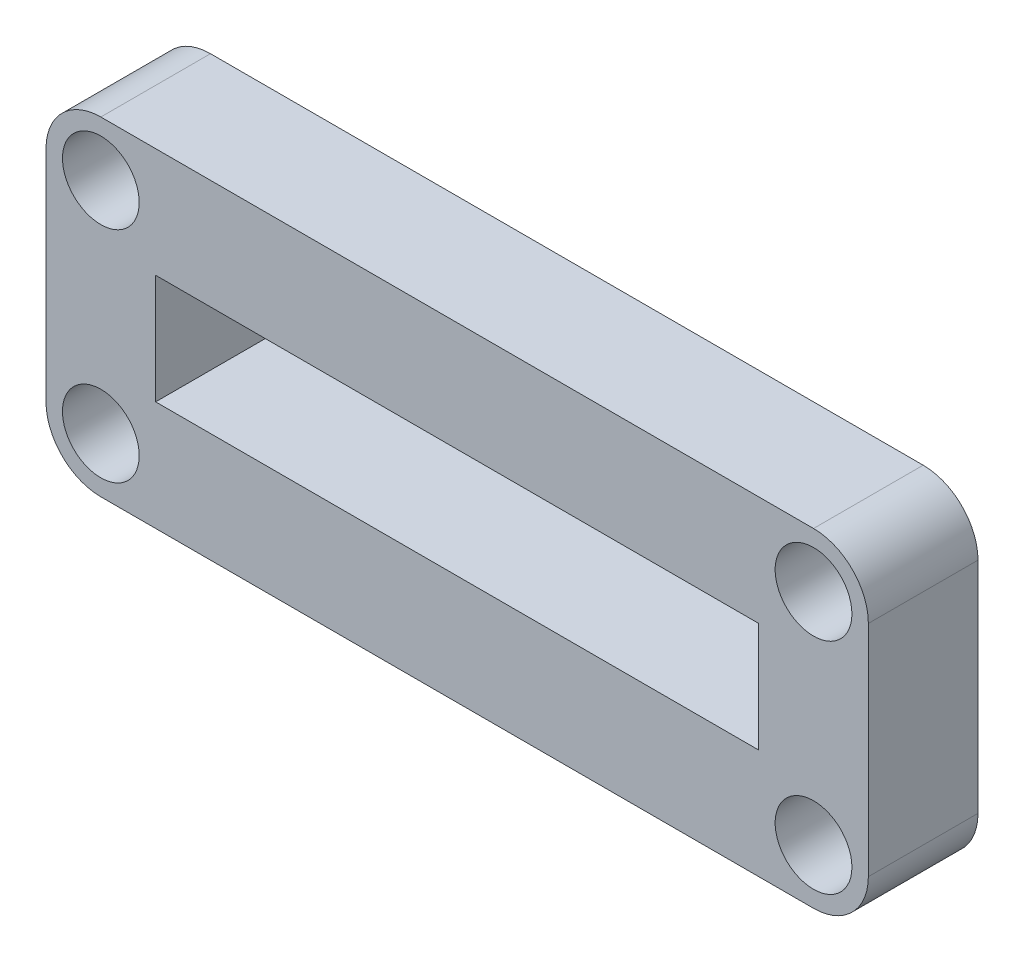
ISO-10303-21;
HEADER;
FILE_DESCRIPTION(('STEP AP214'),'2;1');
FILE_NAME('part.step','',(''),(''),'','','');
FILE_SCHEMA(('AUTOMOTIVE_DESIGN { 1 0 10303 214 1 1 1 1 }'));
ENDSEC;
DATA;
#1=APPLICATION_CONTEXT('core data for automotive mechanical design processes');
#2=APPLICATION_PROTOCOL_DEFINITION('international standard','automotive_design',2000,#1);
#3=PRODUCT_CONTEXT('',#1,'mechanical');
#4=PRODUCT('Part','Part','',(#3));
#5=PRODUCT_RELATED_PRODUCT_CATEGORY('part','',(#4));
#6=PRODUCT_DEFINITION_FORMATION('','',#4);
#7=PRODUCT_DEFINITION_CONTEXT('part definition',#1,'design');
#8=PRODUCT_DEFINITION('design','',#6,#7);
#9=PRODUCT_DEFINITION_SHAPE('','',#8);
#10=(LENGTH_UNIT() NAMED_UNIT(*) SI_UNIT(.MILLI.,.METRE.));
#11=(NAMED_UNIT(*) PLANE_ANGLE_UNIT() SI_UNIT($,.RADIAN.));
#12=(NAMED_UNIT(*) SI_UNIT($,.STERADIAN.) SOLID_ANGLE_UNIT());
#13=UNCERTAINTY_MEASURE_WITH_UNIT(LENGTH_MEASURE(1.E-05),#10,'distance_accuracy_value','');
#14=(GEOMETRIC_REPRESENTATION_CONTEXT(3) GLOBAL_UNCERTAINTY_ASSIGNED_CONTEXT((#13)) GLOBAL_UNIT_ASSIGNED_CONTEXT((#10,
#11,#12)) REPRESENTATION_CONTEXT('',''));
#15=CARTESIAN_POINT('',(0.,0.,0.));
#16=DIRECTION('',(0.,0.,1.));
#17=DIRECTION('',(1.,0.,0.));
#18=AXIS2_PLACEMENT_3D('',#15,#16,#17);
#19=CARTESIAN_POINT('',(0.,0.,7.));
#20=DIRECTION('',(0.,0.,-1.));
#21=DIRECTION('',(-1.,0.,0.));
#22=AXIS2_PLACEMENT_3D('',#19,#20,#21);
#23=CYLINDRICAL_SURFACE('',#22,1.4);
#24=CARTESIAN_POINT('',(0.,0.,0.));
#25=DIRECTION('',(0.,0.,1.));
#26=DIRECTION('',(1.,0.,0.));
#27=AXIS2_PLACEMENT_3D('',#24,#25,#26);
#28=CIRCLE('',#27,1.4);
#29=CARTESIAN_POINT('',(1.4,0.,0.));
#30=VERTEX_POINT('',#29);
#31=EDGE_CURVE('E206',#30,#30,#28,.T.);
#32=ORIENTED_EDGE('',*,*,#31,.F.);
#33=EDGE_LOOP('',(#32));
#34=FACE_BOUND('',#33,.T.);
#35=CARTESIAN_POINT('',(0.,0.,4.));
#36=DIRECTION('',(0.,0.,1.));
#37=DIRECTION('',(1.,0.,0.));
#38=AXIS2_PLACEMENT_3D('',#35,#36,#37);
#39=CIRCLE('',#38,1.4);
#40=CARTESIAN_POINT('',(1.4,0.,4.));
#41=VERTEX_POINT('',#40);
#42=EDGE_CURVE('E176',#41,#41,#39,.T.);
#43=ORIENTED_EDGE('',*,*,#42,.T.);
#44=EDGE_LOOP('',(#43));
#45=FACE_BOUND('',#44,.T.);
#46=ADVANCED_FACE('F69',(#34,#45),#23,.F.);
#47=CARTESIAN_POINT('',(0.,-8.,7.));
#48=DIRECTION('',(0.,0.,-1.));
#49=DIRECTION('',(-1.,0.,0.));
#50=AXIS2_PLACEMENT_3D('',#47,#48,#49);
#51=CYLINDRICAL_SURFACE('',#50,1.4);
#52=CARTESIAN_POINT('',(0.,-8.,0.));
#53=DIRECTION('',(0.,0.,1.));
#54=DIRECTION('',(1.,0.,0.));
#55=AXIS2_PLACEMENT_3D('',#52,#53,#54);
#56=CIRCLE('',#55,1.4);
#57=CARTESIAN_POINT('',(1.4,-8.,0.));
#58=VERTEX_POINT('',#57);
#59=EDGE_CURVE('E203',#58,#58,#56,.T.);
#60=ORIENTED_EDGE('',*,*,#59,.F.);
#61=EDGE_LOOP('',(#60));
#62=FACE_BOUND('',#61,.T.);
#63=CARTESIAN_POINT('',(0.,-8.,4.));
#64=DIRECTION('',(0.,0.,1.));
#65=DIRECTION('',(1.,0.,0.));
#66=AXIS2_PLACEMENT_3D('',#63,#64,#65);
#67=CIRCLE('',#66,1.4);
#68=CARTESIAN_POINT('',(1.4,-8.,4.));
#69=VERTEX_POINT('',#68);
#70=EDGE_CURVE('E181',#69,#69,#67,.T.);
#71=ORIENTED_EDGE('',*,*,#70,.T.);
#72=EDGE_LOOP('',(#71));
#73=FACE_BOUND('',#72,.T.);
#74=ADVANCED_FACE('F302',(#62,#73),#51,.F.);
#75=CARTESIAN_POINT('',(26.,0.,7.));
#76=DIRECTION('',(0.,0.,-1.));
#77=DIRECTION('',(-1.,0.,0.));
#78=AXIS2_PLACEMENT_3D('',#75,#76,#77);
#79=CYLINDRICAL_SURFACE('',#78,1.4);
#80=CARTESIAN_POINT('',(26.,0.,0.));
#81=DIRECTION('',(0.,0.,1.));
#82=DIRECTION('',(1.,0.,0.));
#83=AXIS2_PLACEMENT_3D('',#80,#81,#82);
#84=CIRCLE('',#83,1.4);
#85=CARTESIAN_POINT('',(27.4,0.,0.));
#86=VERTEX_POINT('',#85);
#87=EDGE_CURVE('E200',#86,#86,#84,.T.);
#88=ORIENTED_EDGE('',*,*,#87,.F.);
#89=EDGE_LOOP('',(#88));
#90=FACE_BOUND('',#89,.T.);
#91=CARTESIAN_POINT('',(26.,0.,4.));
#92=DIRECTION('',(0.,0.,1.));
#93=DIRECTION('',(1.,0.,0.));
#94=AXIS2_PLACEMENT_3D('',#91,#92,#93);
#95=CIRCLE('',#94,1.4);
#96=CARTESIAN_POINT('',(27.4,0.,4.));
#97=VERTEX_POINT('',#96);
#98=EDGE_CURVE('E296',#97,#97,#95,.T.);
#99=ORIENTED_EDGE('',*,*,#98,.T.);
#100=EDGE_LOOP('',(#99));
#101=FACE_BOUND('',#100,.T.);
#102=ADVANCED_FACE('F315',(#90,#101),#79,.F.);
#103=CARTESIAN_POINT('',(26.,-8.,7.));
#104=DIRECTION('',(0.,0.,-1.));
#105=DIRECTION('',(-1.,0.,0.));
#106=AXIS2_PLACEMENT_3D('',#103,#104,#105);
#107=CYLINDRICAL_SURFACE('',#106,1.4);
#108=CARTESIAN_POINT('',(26.,-8.,0.));
#109=DIRECTION('',(0.,0.,1.));
#110=DIRECTION('',(1.,0.,0.));
#111=AXIS2_PLACEMENT_3D('',#108,#109,#110);
#112=CIRCLE('',#111,1.4);
#113=CARTESIAN_POINT('',(27.4,-8.,0.));
#114=VERTEX_POINT('',#113);
#115=EDGE_CURVE('E188',#114,#114,#112,.T.);
#116=ORIENTED_EDGE('',*,*,#115,.F.);
#117=EDGE_LOOP('',(#116));
#118=FACE_BOUND('',#117,.T.);
#119=CARTESIAN_POINT('',(26.,-8.,4.));
#120=DIRECTION('',(0.,0.,1.));
#121=DIRECTION('',(1.,0.,0.));
#122=AXIS2_PLACEMENT_3D('',#119,#120,#121);
#123=CIRCLE('',#122,1.4);
#124=CARTESIAN_POINT('',(27.4,-8.,4.));
#125=VERTEX_POINT('',#124);
#126=EDGE_CURVE('E293',#125,#125,#123,.T.);
#127=ORIENTED_EDGE('',*,*,#126,.T.);
#128=EDGE_LOOP('',(#127));
#129=FACE_BOUND('',#128,.T.);
#130=ADVANCED_FACE('F312',(#118,#129),#107,.F.);
#131=CARTESIAN_POINT('',(2.,0.,-1.5));
#132=DIRECTION('',(-1.,0.,0.));
#133=DIRECTION('',(0.,0.,1.));
#134=AXIS2_PLACEMENT_3D('',#131,#132,#133);
#135=PLANE('',#134);
#136=DIRECTION('',(0.,1.,0.));
#137=VECTOR('',#136,1.);
#138=CARTESIAN_POINT('',(2.,0.,4.));
#139=LINE('',#138,#137);
#140=CARTESIAN_POINT('',(2.,-6.,4.));
#141=VERTEX_POINT('',#140);
#142=CARTESIAN_POINT('',(2.,-2.,4.));
#143=VERTEX_POINT('',#142);
#144=EDGE_CURVE('E291',#141,#143,#139,.T.);
#145=ORIENTED_EDGE('',*,*,#144,.F.);
#146=DIRECTION('',(0.,0.,1.));
#147=VECTOR('',#146,1.);
#148=CARTESIAN_POINT('',(2.,-6.,-1.5));
#149=LINE('',#148,#147);
#150=CARTESIAN_POINT('',(2.,-6.,0.));
#151=VERTEX_POINT('',#150);
#152=EDGE_CURVE('E195',#151,#141,#149,.T.);
#153=ORIENTED_EDGE('',*,*,#152,.F.);
#154=DIRECTION('',(0.,-1.,0.));
#155=VECTOR('',#154,1.);
#156=CARTESIAN_POINT('',(2.,0.,0.));
#157=LINE('',#156,#155);
#158=CARTESIAN_POINT('',(2.,-2.,0.));
#159=VERTEX_POINT('',#158);
#160=EDGE_CURVE('E217',#159,#151,#157,.T.);
#161=ORIENTED_EDGE('',*,*,#160,.F.);
#162=DIRECTION('',(0.,0.,1.));
#163=VECTOR('',#162,1.);
#164=CARTESIAN_POINT('',(2.,-2.,-1.5));
#165=LINE('',#164,#163);
#166=EDGE_CURVE('E185',#159,#143,#165,.T.);
#167=ORIENTED_EDGE('',*,*,#166,.T.);
#168=EDGE_LOOP('',(#145,#153,#161,#167));
#169=FACE_BOUND('',#168,.T.);
#170=ADVANCED_FACE('F314',(#169),#135,.F.);
#171=CARTESIAN_POINT('',(0.,-2.,-1.5));
#172=DIRECTION('',(0.,-1.,0.));
#173=DIRECTION('',(1.,0.,0.));
#174=AXIS2_PLACEMENT_3D('',#171,#172,#173);
#175=PLANE('',#174);
#176=DIRECTION('',(0.,0.,1.));
#177=VECTOR('',#176,1.);
#178=CARTESIAN_POINT('',(24.,-2.,-1.5));
#179=LINE('',#178,#177);
#180=CARTESIAN_POINT('',(24.,-2.,0.));
#181=VERTEX_POINT('',#180);
#182=CARTESIAN_POINT('',(24.,-2.,4.));
#183=VERTEX_POINT('',#182);
#184=EDGE_CURVE('E189',#181,#183,#179,.T.);
#185=ORIENTED_EDGE('',*,*,#184,.T.);
#186=DIRECTION('',(-1.,0.,0.));
#187=VECTOR('',#186,1.);
#188=CARTESIAN_POINT('',(0.,-2.,4.));
#189=LINE('',#188,#187);
#190=EDGE_CURVE('E288',#183,#143,#189,.T.);
#191=ORIENTED_EDGE('',*,*,#190,.T.);
#192=ORIENTED_EDGE('',*,*,#166,.F.);
#193=DIRECTION('',(1.,0.,0.));
#194=VECTOR('',#193,1.);
#195=CARTESIAN_POINT('',(0.,-2.,0.));
#196=LINE('',#195,#194);
#197=EDGE_CURVE('E215',#159,#181,#196,.T.);
#198=ORIENTED_EDGE('',*,*,#197,.T.);
#199=EDGE_LOOP('',(#185,#191,#192,#198));
#200=FACE_BOUND('',#199,.T.);
#201=ADVANCED_FACE('F322',(#200),#175,.T.);
#202=CARTESIAN_POINT('',(24.,0.,-1.5));
#203=DIRECTION('',(-1.,0.,0.));
#204=DIRECTION('',(0.,0.,1.));
#205=AXIS2_PLACEMENT_3D('',#202,#203,#204);
#206=PLANE('',#205);
#207=DIRECTION('',(0.,0.,1.));
#208=VECTOR('',#207,1.);
#209=CARTESIAN_POINT('',(24.,-6.,-1.5));
#210=LINE('',#209,#208);
#211=CARTESIAN_POINT('',(24.,-6.,0.));
#212=VERTEX_POINT('',#211);
#213=CARTESIAN_POINT('',(24.,-6.,4.));
#214=VERTEX_POINT('',#213);
#215=EDGE_CURVE('E192',#212,#214,#210,.T.);
#216=ORIENTED_EDGE('',*,*,#215,.T.);
#217=DIRECTION('',(0.,1.,0.));
#218=VECTOR('',#217,1.);
#219=CARTESIAN_POINT('',(24.,0.,4.));
#220=LINE('',#219,#218);
#221=EDGE_CURVE('E84',#214,#183,#220,.T.);
#222=ORIENTED_EDGE('',*,*,#221,.T.);
#223=ORIENTED_EDGE('',*,*,#184,.F.);
#224=DIRECTION('',(0.,-1.,0.));
#225=VECTOR('',#224,1.);
#226=CARTESIAN_POINT('',(24.,0.,0.));
#227=LINE('',#226,#225);
#228=EDGE_CURVE('E212',#181,#212,#227,.T.);
#229=ORIENTED_EDGE('',*,*,#228,.T.);
#230=EDGE_LOOP('',(#216,#222,#223,#229));
#231=FACE_BOUND('',#230,.T.);
#232=ADVANCED_FACE('F352',(#231),#206,.T.);
#233=CARTESIAN_POINT('',(0.,-6.,-1.5));
#234=DIRECTION('',(0.,-1.,0.));
#235=DIRECTION('',(1.,0.,0.));
#236=AXIS2_PLACEMENT_3D('',#233,#234,#235);
#237=PLANE('',#236);
#238=DIRECTION('',(-1.,0.,0.));
#239=VECTOR('',#238,1.);
#240=CARTESIAN_POINT('',(0.,-6.,4.));
#241=LINE('',#240,#239);
#242=EDGE_CURVE('E169',#214,#141,#241,.T.);
#243=ORIENTED_EDGE('',*,*,#242,.F.);
#244=ORIENTED_EDGE('',*,*,#215,.F.);
#245=DIRECTION('',(1.,0.,0.));
#246=VECTOR('',#245,1.);
#247=CARTESIAN_POINT('',(0.,-6.,0.));
#248=LINE('',#247,#246);
#249=EDGE_CURVE('E209',#151,#212,#248,.T.);
#250=ORIENTED_EDGE('',*,*,#249,.F.);
#251=ORIENTED_EDGE('',*,*,#152,.T.);
#252=EDGE_LOOP('',(#243,#244,#250,#251));
#253=FACE_BOUND('',#252,.T.);
#254=ADVANCED_FACE('F354',(#253),#237,.F.);
#255=CARTESIAN_POINT('',(0.,-8.,-1.5));
#256=DIRECTION('',(0.,0.,1.));
#257=DIRECTION('',(1.,0.,0.));
#258=AXIS2_PLACEMENT_3D('',#255,#256,#257);
#259=CYLINDRICAL_SURFACE('',#258,2.);
#260=DIRECTION('',(0.,0.,1.));
#261=VECTOR('',#260,1.);
#262=CARTESIAN_POINT('',(0.,-10.,-1.5));
#263=LINE('',#262,#261);
#264=CARTESIAN_POINT('',(0.,-10.,0.));
#265=VERTEX_POINT('',#264);
#266=CARTESIAN_POINT('',(0.,-10.,4.));
#267=VERTEX_POINT('',#266);
#268=EDGE_CURVE('E168',#265,#267,#263,.T.);
#269=ORIENTED_EDGE('',*,*,#268,.T.);
#270=CARTESIAN_POINT('',(0.,-8.,4.));
#271=DIRECTION('',(0.,0.,1.));
#272=DIRECTION('',(1.,0.,0.));
#273=AXIS2_PLACEMENT_3D('',#270,#271,#272);
#274=CIRCLE('',#273,2.);
#275=CARTESIAN_POINT('',(-2.,-8.,4.));
#276=VERTEX_POINT('',#275);
#277=EDGE_CURVE('E156',#267,#276,#274,.F.);
#278=ORIENTED_EDGE('',*,*,#277,.T.);
#279=DIRECTION('',(0.,0.,1.));
#280=VECTOR('',#279,1.);
#281=CARTESIAN_POINT('',(-2.,-8.,-1.5));
#282=LINE('',#281,#280);
#283=CARTESIAN_POINT('',(-2.,-8.,0.));
#284=VERTEX_POINT('',#283);
#285=EDGE_CURVE('E165',#284,#276,#282,.T.);
#286=ORIENTED_EDGE('',*,*,#285,.F.);
#287=CARTESIAN_POINT('',(0.,-8.,0.));
#288=DIRECTION('',(0.,0.,1.));
#289=DIRECTION('',(1.,0.,0.));
#290=AXIS2_PLACEMENT_3D('',#287,#288,#289);
#291=CIRCLE('',#290,2.);
#292=EDGE_CURVE('E77',#284,#265,#291,.T.);
#293=ORIENTED_EDGE('',*,*,#292,.T.);
#294=EDGE_LOOP('',(#269,#278,#286,#293));
#295=FACE_BOUND('',#294,.T.);
#296=ADVANCED_FACE('F164',(#295),#259,.T.);
#297=CARTESIAN_POINT('',(0.,-10.,-1.5));
#298=DIRECTION('',(0.,-1.,0.));
#299=DIRECTION('',(1.,0.,0.));
#300=AXIS2_PLACEMENT_3D('',#297,#298,#299);
#301=PLANE('',#300);
#302=DIRECTION('',(0.,0.,1.));
#303=VECTOR('',#302,1.);
#304=CARTESIAN_POINT('',(26.,-10.,-1.5));
#305=LINE('',#304,#303);
#306=CARTESIAN_POINT('',(26.,-10.,0.));
#307=VERTEX_POINT('',#306);
#308=CARTESIAN_POINT('',(26.,-10.,4.));
#309=VERTEX_POINT('',#308);
#310=EDGE_CURVE('E239',#307,#309,#305,.T.);
#311=ORIENTED_EDGE('',*,*,#310,.T.);
#312=DIRECTION('',(-1.,0.,0.));
#313=VECTOR('',#312,1.);
#314=CARTESIAN_POINT('',(0.,-10.,4.));
#315=LINE('',#314,#313);
#316=EDGE_CURVE('E170',#309,#267,#315,.T.);
#317=ORIENTED_EDGE('',*,*,#316,.T.);
#318=ORIENTED_EDGE('',*,*,#268,.F.);
#319=DIRECTION('',(1.,0.,0.));
#320=VECTOR('',#319,1.);
#321=CARTESIAN_POINT('',(0.,-10.,0.));
#322=LINE('',#321,#320);
#323=EDGE_CURVE('E232',#265,#307,#322,.T.);
#324=ORIENTED_EDGE('',*,*,#323,.T.);
#325=EDGE_LOOP('',(#311,#317,#318,#324));
#326=FACE_BOUND('',#325,.T.);
#327=ADVANCED_FACE('F237',(#326),#301,.T.);
#328=CARTESIAN_POINT('',(26.,-8.,-1.5));
#329=DIRECTION('',(0.,0.,1.));
#330=DIRECTION('',(1.,0.,0.));
#331=AXIS2_PLACEMENT_3D('',#328,#329,#330);
#332=CYLINDRICAL_SURFACE('',#331,2.);
#333=DIRECTION('',(0.,0.,1.));
#334=VECTOR('',#333,1.);
#335=CARTESIAN_POINT('',(28.,-8.,-1.5));
#336=LINE('',#335,#334);
#337=CARTESIAN_POINT('',(28.,-8.,0.));
#338=VERTEX_POINT('',#337);
#339=CARTESIAN_POINT('',(28.,-8.,4.));
#340=VERTEX_POINT('',#339);
#341=EDGE_CURVE('E249',#338,#340,#336,.T.);
#342=ORIENTED_EDGE('',*,*,#341,.T.);
#343=CARTESIAN_POINT('',(26.,-8.,4.));
#344=DIRECTION('',(0.,0.,1.));
#345=DIRECTION('',(1.,0.,0.));
#346=AXIS2_PLACEMENT_3D('',#343,#344,#345);
#347=CIRCLE('',#346,2.);
#348=EDGE_CURVE('E279',#340,#309,#347,.F.);
#349=ORIENTED_EDGE('',*,*,#348,.T.);
#350=ORIENTED_EDGE('',*,*,#310,.F.);
#351=CARTESIAN_POINT('',(26.,-8.,0.));
#352=DIRECTION('',(0.,0.,1.));
#353=DIRECTION('',(1.,0.,0.));
#354=AXIS2_PLACEMENT_3D('',#351,#352,#353);
#355=CIRCLE('',#354,2.);
#356=EDGE_CURVE('E230',#307,#338,#355,.T.);
#357=ORIENTED_EDGE('',*,*,#356,.T.);
#358=EDGE_LOOP('',(#342,#349,#350,#357));
#359=FACE_BOUND('',#358,.T.);
#360=ADVANCED_FACE('F247',(#359),#332,.T.);
#361=CARTESIAN_POINT('',(28.,0.,-1.5));
#362=DIRECTION('',(1.,0.,0.));
#363=DIRECTION('',(0.,1.,0.));
#364=AXIS2_PLACEMENT_3D('',#361,#362,#363);
#365=PLANE('',#364);
#366=DIRECTION('',(0.,0.,1.));
#367=VECTOR('',#366,1.);
#368=CARTESIAN_POINT('',(28.,0.,-1.5));
#369=LINE('',#368,#367);
#370=CARTESIAN_POINT('',(28.,0.,0.));
#371=VERTEX_POINT('',#370);
#372=CARTESIAN_POINT('',(28.,0.,4.));
#373=VERTEX_POINT('',#372);
#374=EDGE_CURVE('E256',#371,#373,#369,.T.);
#375=ORIENTED_EDGE('',*,*,#374,.T.);
#376=DIRECTION('',(0.,-1.,0.));
#377=VECTOR('',#376,1.);
#378=CARTESIAN_POINT('',(28.,0.,4.));
#379=LINE('',#378,#377);
#380=EDGE_CURVE('E255',#373,#340,#379,.T.);
#381=ORIENTED_EDGE('',*,*,#380,.T.);
#382=ORIENTED_EDGE('',*,*,#341,.F.);
#383=DIRECTION('',(0.,1.,0.));
#384=VECTOR('',#383,1.);
#385=CARTESIAN_POINT('',(28.,0.,0.));
#386=LINE('',#385,#384);
#387=EDGE_CURVE('E228',#338,#371,#386,.T.);
#388=ORIENTED_EDGE('',*,*,#387,.T.);
#389=EDGE_LOOP('',(#375,#381,#382,#388));
#390=FACE_BOUND('',#389,.T.);
#391=ADVANCED_FACE('F253',(#390),#365,.T.);
#392=CARTESIAN_POINT('',(26.,0.,-1.5));
#393=DIRECTION('',(0.,0.,1.));
#394=DIRECTION('',(1.,0.,0.));
#395=AXIS2_PLACEMENT_3D('',#392,#393,#394);
#396=CYLINDRICAL_SURFACE('',#395,2.);
#397=DIRECTION('',(0.,0.,1.));
#398=VECTOR('',#397,1.);
#399=CARTESIAN_POINT('',(26.,2.,-1.5));
#400=LINE('',#399,#398);
#401=CARTESIAN_POINT('',(26.,2.,0.));
#402=VERTEX_POINT('',#401);
#403=CARTESIAN_POINT('',(26.,2.,4.));
#404=VERTEX_POINT('',#403);
#405=EDGE_CURVE('E259',#402,#404,#400,.T.);
#406=ORIENTED_EDGE('',*,*,#405,.T.);
#407=CARTESIAN_POINT('',(26.,0.,4.));
#408=DIRECTION('',(0.,0.,1.));
#409=DIRECTION('',(1.,0.,0.));
#410=AXIS2_PLACEMENT_3D('',#407,#408,#409);
#411=CIRCLE('',#410,2.);
#412=EDGE_CURVE('E277',#404,#373,#411,.F.);
#413=ORIENTED_EDGE('',*,*,#412,.T.);
#414=ORIENTED_EDGE('',*,*,#374,.F.);
#415=CARTESIAN_POINT('',(26.,0.,0.));
#416=DIRECTION('',(0.,0.,1.));
#417=DIRECTION('',(1.,0.,0.));
#418=AXIS2_PLACEMENT_3D('',#415,#416,#417);
#419=CIRCLE('',#418,2.);
#420=EDGE_CURVE('E226',#371,#402,#419,.T.);
#421=ORIENTED_EDGE('',*,*,#420,.T.);
#422=EDGE_LOOP('',(#406,#413,#414,#421));
#423=FACE_BOUND('',#422,.T.);
#424=ADVANCED_FACE('F275',(#423),#396,.T.);
#425=CARTESIAN_POINT('',(0.,2.,-1.5));
#426=DIRECTION('',(0.,1.,0.));
#427=DIRECTION('',(-1.,0.,0.));
#428=AXIS2_PLACEMENT_3D('',#425,#426,#427);
#429=PLANE('',#428);
#430=DIRECTION('',(0.,0.,1.));
#431=VECTOR('',#430,1.);
#432=CARTESIAN_POINT('',(0.,2.,-1.5));
#433=LINE('',#432,#431);
#434=CARTESIAN_POINT('',(0.,2.,0.));
#435=VERTEX_POINT('',#434);
#436=CARTESIAN_POINT('',(0.,2.,4.));
#437=VERTEX_POINT('',#436);
#438=EDGE_CURVE('E178',#435,#437,#433,.T.);
#439=ORIENTED_EDGE('',*,*,#438,.T.);
#440=DIRECTION('',(1.,0.,0.));
#441=VECTOR('',#440,1.);
#442=CARTESIAN_POINT('',(0.,2.,4.));
#443=LINE('',#442,#441);
#444=EDGE_CURVE('E269',#437,#404,#443,.T.);
#445=ORIENTED_EDGE('',*,*,#444,.T.);
#446=ORIENTED_EDGE('',*,*,#405,.F.);
#447=DIRECTION('',(-1.,0.,0.));
#448=VECTOR('',#447,1.);
#449=CARTESIAN_POINT('',(0.,2.,0.));
#450=LINE('',#449,#448);
#451=EDGE_CURVE('E224',#402,#435,#450,.T.);
#452=ORIENTED_EDGE('',*,*,#451,.T.);
#453=EDGE_LOOP('',(#439,#445,#446,#452));
#454=FACE_BOUND('',#453,.T.);
#455=ADVANCED_FACE('F267',(#454),#429,.T.);
#456=CARTESIAN_POINT('',(0.,0.,-1.5));
#457=DIRECTION('',(0.,0.,1.));
#458=DIRECTION('',(1.,0.,0.));
#459=AXIS2_PLACEMENT_3D('',#456,#457,#458);
#460=CYLINDRICAL_SURFACE('',#459,2.);
#461=DIRECTION('',(0.,0.,1.));
#462=VECTOR('',#461,1.);
#463=CARTESIAN_POINT('',(-2.,0.,-1.5));
#464=LINE('',#463,#462);
#465=CARTESIAN_POINT('',(-2.,0.,0.));
#466=VERTEX_POINT('',#465);
#467=CARTESIAN_POINT('',(-2.,0.,4.));
#468=VERTEX_POINT('',#467);
#469=EDGE_CURVE('E175',#466,#468,#464,.T.);
#470=ORIENTED_EDGE('',*,*,#469,.T.);
#471=CARTESIAN_POINT('',(0.,0.,4.));
#472=DIRECTION('',(0.,0.,1.));
#473=DIRECTION('',(1.,0.,0.));
#474=AXIS2_PLACEMENT_3D('',#471,#472,#473);
#475=CIRCLE('',#474,2.);
#476=EDGE_CURVE('E92',#468,#437,#475,.F.);
#477=ORIENTED_EDGE('',*,*,#476,.T.);
#478=ORIENTED_EDGE('',*,*,#438,.F.);
#479=CARTESIAN_POINT('',(0.,0.,0.));
#480=DIRECTION('',(0.,0.,1.));
#481=DIRECTION('',(1.,0.,0.));
#482=AXIS2_PLACEMENT_3D('',#479,#480,#481);
#483=CIRCLE('',#482,2.);
#484=EDGE_CURVE('E221',#435,#466,#483,.T.);
#485=ORIENTED_EDGE('',*,*,#484,.T.);
#486=EDGE_LOOP('',(#470,#477,#478,#485));
#487=FACE_BOUND('',#486,.T.);
#488=ADVANCED_FACE('F273',(#487),#460,.T.);
#489=CARTESIAN_POINT('',(-2.,0.,-1.5));
#490=DIRECTION('',(-1.,0.,0.));
#491=DIRECTION('',(0.,0.,1.));
#492=AXIS2_PLACEMENT_3D('',#489,#490,#491);
#493=PLANE('',#492);
#494=ORIENTED_EDGE('',*,*,#285,.T.);
#495=DIRECTION('',(0.,1.,0.));
#496=VECTOR('',#495,1.);
#497=CARTESIAN_POINT('',(-2.,0.,4.));
#498=LINE('',#497,#496);
#499=EDGE_CURVE('E12',#276,#468,#498,.T.);
#500=ORIENTED_EDGE('',*,*,#499,.T.);
#501=ORIENTED_EDGE('',*,*,#469,.F.);
#502=DIRECTION('',(0.,-1.,0.));
#503=VECTOR('',#502,1.);
#504=CARTESIAN_POINT('',(-2.,0.,0.));
#505=LINE('',#504,#503);
#506=EDGE_CURVE('E174',#466,#284,#505,.T.);
#507=ORIENTED_EDGE('',*,*,#506,.T.);
#508=EDGE_LOOP('',(#494,#500,#501,#507));
#509=FACE_BOUND('',#508,.T.);
#510=ADVANCED_FACE('F172',(#509),#493,.T.);
#511=CARTESIAN_POINT('',(0.,0.,0.));
#512=DIRECTION('',(0.,0.,1.));
#513=DIRECTION('',(1.,0.,0.));
#514=AXIS2_PLACEMENT_3D('',#511,#512,#513);
#515=PLANE('',#514);
#516=ORIENTED_EDGE('',*,*,#31,.T.);
#517=EDGE_LOOP('',(#516));
#518=FACE_BOUND('',#517,.T.);
#519=ORIENTED_EDGE('',*,*,#59,.T.);
#520=EDGE_LOOP('',(#519));
#521=FACE_BOUND('',#520,.T.);
#522=ORIENTED_EDGE('',*,*,#87,.T.);
#523=EDGE_LOOP('',(#522));
#524=FACE_BOUND('',#523,.T.);
#525=ORIENTED_EDGE('',*,*,#115,.T.);
#526=EDGE_LOOP('',(#525));
#527=FACE_BOUND('',#526,.T.);
#528=ORIENTED_EDGE('',*,*,#197,.F.);
#529=ORIENTED_EDGE('',*,*,#160,.T.);
#530=ORIENTED_EDGE('',*,*,#249,.T.);
#531=ORIENTED_EDGE('',*,*,#228,.F.);
#532=EDGE_LOOP('',(#528,#529,#530,#531));
#533=FACE_BOUND('',#532,.T.);
#534=ORIENTED_EDGE('',*,*,#292,.F.);
#535=ORIENTED_EDGE('',*,*,#506,.F.);
#536=ORIENTED_EDGE('',*,*,#484,.F.);
#537=ORIENTED_EDGE('',*,*,#451,.F.);
#538=ORIENTED_EDGE('',*,*,#420,.F.);
#539=ORIENTED_EDGE('',*,*,#387,.F.);
#540=ORIENTED_EDGE('',*,*,#356,.F.);
#541=ORIENTED_EDGE('',*,*,#323,.F.);
#542=EDGE_LOOP('',(#534,#535,#536,#537,#538,#539,#540,#541));
#543=FACE_BOUND('',#542,.T.);
#544=ADVANCED_FACE('F71',(#518,#521,#524,#527,#533,#543),#515,.F.);
#545=CARTESIAN_POINT('',(0.,0.278776736365671,4.));
#546=DIRECTION('',(0.,0.,1.));
#547=DIRECTION('',(1.,0.,0.));
#548=AXIS2_PLACEMENT_3D('',#545,#546,#547);
#549=PLANE('',#548);
#550=ORIENTED_EDGE('',*,*,#42,.F.);
#551=EDGE_LOOP('',(#550));
#552=FACE_BOUND('',#551,.T.);
#553=ORIENTED_EDGE('',*,*,#70,.F.);
#554=EDGE_LOOP('',(#553));
#555=FACE_BOUND('',#554,.T.);
#556=ORIENTED_EDGE('',*,*,#98,.F.);
#557=EDGE_LOOP('',(#556));
#558=FACE_BOUND('',#557,.T.);
#559=ORIENTED_EDGE('',*,*,#126,.F.);
#560=EDGE_LOOP('',(#559));
#561=FACE_BOUND('',#560,.T.);
#562=ORIENTED_EDGE('',*,*,#316,.F.);
#563=ORIENTED_EDGE('',*,*,#348,.F.);
#564=ORIENTED_EDGE('',*,*,#380,.F.);
#565=ORIENTED_EDGE('',*,*,#412,.F.);
#566=ORIENTED_EDGE('',*,*,#444,.F.);
#567=ORIENTED_EDGE('',*,*,#476,.F.);
#568=ORIENTED_EDGE('',*,*,#499,.F.);
#569=ORIENTED_EDGE('',*,*,#277,.F.);
#570=EDGE_LOOP('',(#562,#563,#564,#565,#566,#567,#568,#569));
#571=FACE_BOUND('',#570,.T.);
#572=ORIENTED_EDGE('',*,*,#144,.T.);
#573=ORIENTED_EDGE('',*,*,#190,.F.);
#574=ORIENTED_EDGE('',*,*,#221,.F.);
#575=ORIENTED_EDGE('',*,*,#242,.T.);
#576=EDGE_LOOP('',(#572,#573,#574,#575));
#577=FACE_BOUND('',#576,.T.);
#578=ADVANCED_FACE('F155',(#552,#555,#558,#561,#571,#577),#549,.T.);
#579=CLOSED_SHELL('',(#46,#74,#102,#130,#170,#201,#232,#254,#296,#327,#360,#391,#424,#455,#488,
#510,#544,#578));
#580=MANIFOLD_SOLID_BREP('B2',#579);
#581=ADVANCED_BREP_SHAPE_REPRESENTATION('',(#18,#580),#14);
#582=SHAPE_DEFINITION_REPRESENTATION(#9,#581);
ENDSEC;
END-ISO-10303-21;
